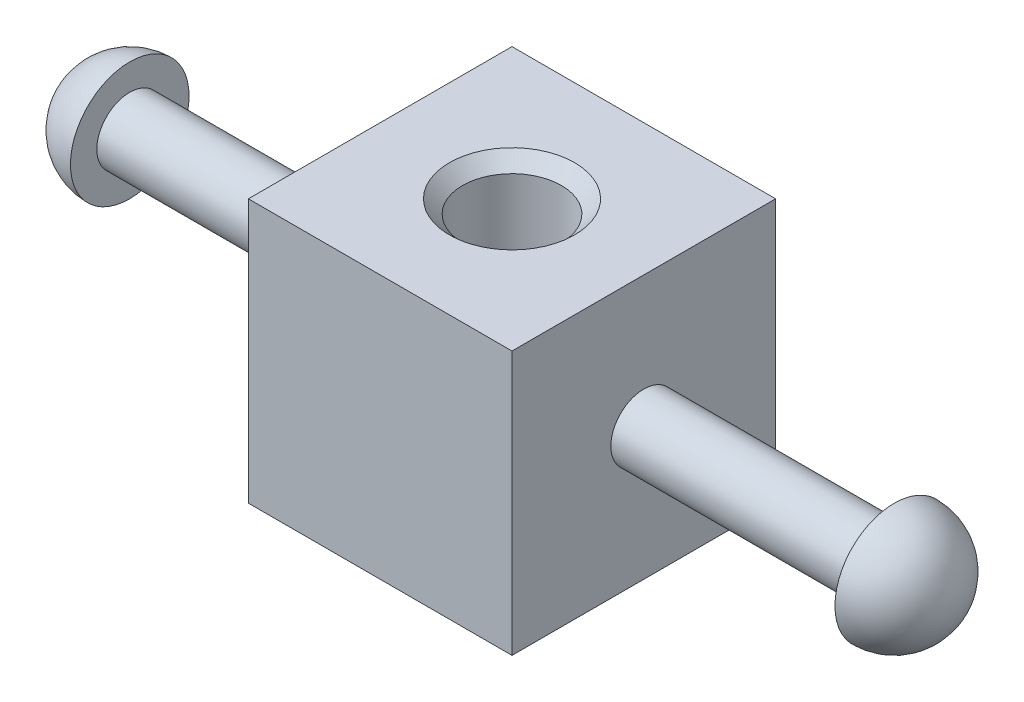
ISO-10303-21;
HEADER;
FILE_DESCRIPTION(('STEP AP214'),'2;1');
FILE_NAME('part.step','',(''),(''),'','','');
FILE_SCHEMA(('AUTOMOTIVE_DESIGN { 1 0 10303 214 1 1 1 1 }'));
ENDSEC;
DATA;
#1=APPLICATION_CONTEXT('core data for automotive mechanical design processes');
#2=APPLICATION_PROTOCOL_DEFINITION('international standard','automotive_design',2000,#1);
#3=PRODUCT_CONTEXT('',#1,'mechanical');
#4=PRODUCT('Part','Part','',(#3));
#5=PRODUCT_RELATED_PRODUCT_CATEGORY('part','',(#4));
#6=PRODUCT_DEFINITION_FORMATION('','',#4);
#7=PRODUCT_DEFINITION_CONTEXT('part definition',#1,'design');
#8=PRODUCT_DEFINITION('design','',#6,#7);
#9=PRODUCT_DEFINITION_SHAPE('','',#8);
#10=(LENGTH_UNIT() NAMED_UNIT(*) SI_UNIT(.MILLI.,.METRE.));
#11=(NAMED_UNIT(*) PLANE_ANGLE_UNIT() SI_UNIT($,.RADIAN.));
#12=(NAMED_UNIT(*) SI_UNIT($,.STERADIAN.) SOLID_ANGLE_UNIT());
#13=UNCERTAINTY_MEASURE_WITH_UNIT(LENGTH_MEASURE(1.E-05),#10,'distance_accuracy_value','');
#14=(GEOMETRIC_REPRESENTATION_CONTEXT(3) GLOBAL_UNCERTAINTY_ASSIGNED_CONTEXT((#13)) GLOBAL_UNIT_ASSIGNED_CONTEXT((#10,
#11,#12)) REPRESENTATION_CONTEXT('',''));
#15=CARTESIAN_POINT('',(0.,0.,0.));
#16=DIRECTION('',(0.,0.,1.));
#17=DIRECTION('',(1.,0.,0.));
#18=AXIS2_PLACEMENT_3D('',#15,#16,#17);
#19=CARTESIAN_POINT('',(0.,25.4,0.));
#20=DIRECTION('',(0.,-1.,0.));
#21=DIRECTION('',(0.,0.,-1.));
#22=AXIS2_PLACEMENT_3D('',#19,#20,#21);
#23=PLANE('',#22);
#24=CARTESIAN_POINT('',(0.,25.4,0.));
#25=DIRECTION('',(0.,-1.,0.));
#26=DIRECTION('',(0.,0.,-1.));
#27=AXIS2_PLACEMENT_3D('',#24,#25,#26);
#28=CIRCLE('',#27,6.03250000000001);
#29=CARTESIAN_POINT('',(0.,25.4,-6.03250000000001));
#30=VERTEX_POINT('',#29);
#31=EDGE_CURVE('E11',#30,#30,#28,.T.);
#32=ORIENTED_EDGE('',*,*,#31,.T.);
#33=EDGE_LOOP('',(#32));
#34=FACE_BOUND('',#33,.T.);
#35=DIRECTION('',(0.,0.,-1.));
#36=VECTOR('',#35,1.);
#37=CARTESIAN_POINT('',(12.7,25.4,12.7));
#38=LINE('',#37,#36);
#39=CARTESIAN_POINT('',(12.7,25.4,12.7));
#40=VERTEX_POINT('',#39);
#41=CARTESIAN_POINT('',(12.7,25.4,-12.7));
#42=VERTEX_POINT('',#41);
#43=EDGE_CURVE('E99',#40,#42,#38,.T.);
#44=ORIENTED_EDGE('',*,*,#43,.T.);
#45=DIRECTION('',(-1.,0.,0.));
#46=VECTOR('',#45,1.);
#47=CARTESIAN_POINT('',(-12.7,25.4,-12.7));
#48=LINE('',#47,#46);
#49=CARTESIAN_POINT('',(-12.7,25.4,-12.7));
#50=VERTEX_POINT('',#49);
#51=EDGE_CURVE('E95',#42,#50,#48,.T.);
#52=ORIENTED_EDGE('',*,*,#51,.T.);
#53=DIRECTION('',(0.,0.,1.));
#54=VECTOR('',#53,1.);
#55=CARTESIAN_POINT('',(-12.7,25.4,12.7));
#56=LINE('',#55,#54);
#57=CARTESIAN_POINT('',(-12.7,25.4,12.7));
#58=VERTEX_POINT('',#57);
#59=EDGE_CURVE('E97',#50,#58,#56,.T.);
#60=ORIENTED_EDGE('',*,*,#59,.T.);
#61=DIRECTION('',(1.,0.,0.));
#62=VECTOR('',#61,1.);
#63=CARTESIAN_POINT('',(-12.7,25.4,12.7));
#64=LINE('',#63,#62);
#65=EDGE_CURVE('E64',#58,#40,#64,.T.);
#66=ORIENTED_EDGE('',*,*,#65,.T.);
#67=EDGE_LOOP('',(#44,#52,#60,#66));
#68=FACE_BOUND('',#67,.T.);
#69=ADVANCED_FACE('F45',(#34,#68),#23,.F.);
#70=CARTESIAN_POINT('',(0.,0.,0.));
#71=DIRECTION('',(0.,-1.,0.));
#72=DIRECTION('',(0.,0.,-1.));
#73=AXIS2_PLACEMENT_3D('',#70,#71,#72);
#74=PLANE('',#73);
#75=CARTESIAN_POINT('',(0.,0.,0.));
#76=DIRECTION('',(0.,-1.,0.));
#77=DIRECTION('',(0.,0.,-1.));
#78=AXIS2_PLACEMENT_3D('',#75,#76,#77);
#79=CIRCLE('',#78,6.0325);
#80=CARTESIAN_POINT('',(0.,0.,-6.0325));
#81=VERTEX_POINT('',#80);
#82=EDGE_CURVE('E135',#81,#81,#79,.F.);
#83=ORIENTED_EDGE('',*,*,#82,.T.);
#84=EDGE_LOOP('',(#83));
#85=FACE_BOUND('',#84,.T.);
#86=DIRECTION('',(0.,0.,-1.));
#87=VECTOR('',#86,1.);
#88=CARTESIAN_POINT('',(12.7,0.,12.7));
#89=LINE('',#88,#87);
#90=CARTESIAN_POINT('',(12.7,0.,12.7));
#91=VERTEX_POINT('',#90);
#92=CARTESIAN_POINT('',(12.7,0.,-12.7));
#93=VERTEX_POINT('',#92);
#94=EDGE_CURVE('E118',#91,#93,#89,.T.);
#95=ORIENTED_EDGE('',*,*,#94,.F.);
#96=DIRECTION('',(1.,0.,0.));
#97=VECTOR('',#96,1.);
#98=CARTESIAN_POINT('',(-12.7,0.,12.7));
#99=LINE('',#98,#97);
#100=CARTESIAN_POINT('',(-12.7,0.,12.7));
#101=VERTEX_POINT('',#100);
#102=EDGE_CURVE('E87',#101,#91,#99,.T.);
#103=ORIENTED_EDGE('',*,*,#102,.F.);
#104=DIRECTION('',(0.,0.,1.));
#105=VECTOR('',#104,1.);
#106=CARTESIAN_POINT('',(-12.7,0.,12.7));
#107=LINE('',#106,#105);
#108=CARTESIAN_POINT('',(-12.7,0.,-12.7));
#109=VERTEX_POINT('',#108);
#110=EDGE_CURVE('E81',#109,#101,#107,.T.);
#111=ORIENTED_EDGE('',*,*,#110,.F.);
#112=DIRECTION('',(-1.,0.,0.));
#113=VECTOR('',#112,1.);
#114=CARTESIAN_POINT('',(-12.7,0.,-12.7));
#115=LINE('',#114,#113);
#116=EDGE_CURVE('E105',#93,#109,#115,.T.);
#117=ORIENTED_EDGE('',*,*,#116,.F.);
#118=EDGE_LOOP('',(#95,#103,#111,#117));
#119=FACE_BOUND('',#118,.T.);
#120=ADVANCED_FACE('F154',(#85,#119),#74,.T.);
#121=CARTESIAN_POINT('',(12.7,25.4,12.7));
#122=DIRECTION('',(-1.,0.,0.));
#123=DIRECTION('',(0.,0.,1.));
#124=AXIS2_PLACEMENT_3D('',#121,#122,#123);
#125=PLANE('',#124);
#126=CARTESIAN_POINT('',(12.7,12.7,0.));
#127=DIRECTION('',(-1.,0.,0.));
#128=DIRECTION('',(0.,0.,1.));
#129=AXIS2_PLACEMENT_3D('',#126,#127,#128);
#130=CIRCLE('',#129,3.175);
#131=CARTESIAN_POINT('',(12.7,12.7,3.175));
#132=VERTEX_POINT('',#131);
#133=EDGE_CURVE('E122',#132,#132,#130,.T.);
#134=ORIENTED_EDGE('',*,*,#133,.T.);
#135=EDGE_LOOP('',(#134));
#136=FACE_BOUND('',#135,.T.);
#137=ORIENTED_EDGE('',*,*,#94,.T.);
#138=DIRECTION('',(0.,-1.,0.));
#139=VECTOR('',#138,1.);
#140=CARTESIAN_POINT('',(12.7,25.4,-12.7));
#141=LINE('',#140,#139);
#142=EDGE_CURVE('E107',#42,#93,#141,.T.);
#143=ORIENTED_EDGE('',*,*,#142,.F.);
#144=ORIENTED_EDGE('',*,*,#43,.F.);
#145=DIRECTION('',(0.,-1.,0.));
#146=VECTOR('',#145,1.);
#147=CARTESIAN_POINT('',(12.7,25.4,12.7));
#148=LINE('',#147,#146);
#149=EDGE_CURVE('E114',#40,#91,#148,.T.);
#150=ORIENTED_EDGE('',*,*,#149,.T.);
#151=EDGE_LOOP('',(#137,#143,#144,#150));
#152=FACE_BOUND('',#151,.T.);
#153=ADVANCED_FACE('F157',(#136,#152),#125,.F.);
#154=CARTESIAN_POINT('',(-12.7,25.4,-12.7));
#155=DIRECTION('',(0.,0.,1.));
#156=DIRECTION('',(1.,0.,0.));
#157=AXIS2_PLACEMENT_3D('',#154,#155,#156);
#158=PLANE('',#157);
#159=ORIENTED_EDGE('',*,*,#116,.T.);
#160=DIRECTION('',(0.,-1.,0.));
#161=VECTOR('',#160,1.);
#162=CARTESIAN_POINT('',(-12.7,25.4,-12.7));
#163=LINE('',#162,#161);
#164=EDGE_CURVE('E103',#50,#109,#163,.T.);
#165=ORIENTED_EDGE('',*,*,#164,.F.);
#166=ORIENTED_EDGE('',*,*,#51,.F.);
#167=ORIENTED_EDGE('',*,*,#142,.T.);
#168=EDGE_LOOP('',(#159,#165,#166,#167));
#169=FACE_BOUND('',#168,.T.);
#170=ADVANCED_FACE('F104',(#169),#158,.F.);
#171=CARTESIAN_POINT('',(-12.7,25.4,12.7));
#172=DIRECTION('',(1.,0.,0.));
#173=DIRECTION('',(0.,0.,-1.));
#174=AXIS2_PLACEMENT_3D('',#171,#172,#173);
#175=PLANE('',#174);
#176=CARTESIAN_POINT('',(-12.7,12.7,0.));
#177=DIRECTION('',(1.,0.,0.));
#178=DIRECTION('',(0.,0.,-1.));
#179=AXIS2_PLACEMENT_3D('',#176,#177,#178);
#180=CIRCLE('',#179,3.175);
#181=CARTESIAN_POINT('',(-12.7,12.7,-3.175));
#182=VERTEX_POINT('',#181);
#183=EDGE_CURVE('E220',#182,#182,#180,.T.);
#184=ORIENTED_EDGE('',*,*,#183,.T.);
#185=EDGE_LOOP('',(#184));
#186=FACE_BOUND('',#185,.T.);
#187=ORIENTED_EDGE('',*,*,#110,.T.);
#188=DIRECTION('',(0.,-1.,0.));
#189=VECTOR('',#188,1.);
#190=CARTESIAN_POINT('',(-12.7,25.4,12.7));
#191=LINE('',#190,#189);
#192=EDGE_CURVE('E108',#58,#101,#191,.T.);
#193=ORIENTED_EDGE('',*,*,#192,.F.);
#194=ORIENTED_EDGE('',*,*,#59,.F.);
#195=ORIENTED_EDGE('',*,*,#164,.T.);
#196=EDGE_LOOP('',(#187,#193,#194,#195));
#197=FACE_BOUND('',#196,.T.);
#198=ADVANCED_FACE('F110',(#186,#197),#175,.F.);
#199=CARTESIAN_POINT('',(-12.7,25.4,12.7));
#200=DIRECTION('',(0.,0.,-1.));
#201=DIRECTION('',(-1.,0.,0.));
#202=AXIS2_PLACEMENT_3D('',#199,#200,#201);
#203=PLANE('',#202);
#204=ORIENTED_EDGE('',*,*,#102,.T.);
#205=ORIENTED_EDGE('',*,*,#149,.F.);
#206=ORIENTED_EDGE('',*,*,#65,.F.);
#207=ORIENTED_EDGE('',*,*,#192,.T.);
#208=EDGE_LOOP('',(#204,#205,#206,#207));
#209=FACE_BOUND('',#208,.T.);
#210=ADVANCED_FACE('F161',(#209),#203,.F.);
#211=CARTESIAN_POINT('',(0.,25.4,0.));
#212=DIRECTION('',(0.,-1.,0.));
#213=DIRECTION('',(0.,0.,-1.));
#214=AXIS2_PLACEMENT_3D('',#211,#212,#213);
#215=CYLINDRICAL_SURFACE('',#214,4.7625);
#216=CARTESIAN_POINT('',(0.,1.27,0.));
#217=DIRECTION('',(0.,-1.,0.));
#218=DIRECTION('',(0.,0.,-1.));
#219=AXIS2_PLACEMENT_3D('',#216,#217,#218);
#220=CIRCLE('',#219,4.7625);
#221=CARTESIAN_POINT('',(0.,1.27,-4.7625));
#222=VERTEX_POINT('',#221);
#223=EDGE_CURVE('E56',#222,#222,#220,.T.);
#224=ORIENTED_EDGE('',*,*,#223,.T.);
#225=EDGE_LOOP('',(#224));
#226=FACE_BOUND('',#225,.T.);
#227=CARTESIAN_POINT('',(0.,24.13,0.));
#228=DIRECTION('',(0.,-1.,0.));
#229=DIRECTION('',(0.,0.,-1.));
#230=AXIS2_PLACEMENT_3D('',#227,#228,#229);
#231=CIRCLE('',#230,4.7625);
#232=CARTESIAN_POINT('',(0.,24.13,-4.7625));
#233=VERTEX_POINT('',#232);
#234=EDGE_CURVE('E139',#233,#233,#231,.F.);
#235=ORIENTED_EDGE('',*,*,#234,.T.);
#236=EDGE_LOOP('',(#235));
#237=FACE_BOUND('',#236,.T.);
#238=ADVANCED_FACE('F146',(#226,#237),#215,.F.);
#239=CARTESIAN_POINT('',(0.,0.,0.));
#240=DIRECTION('',(0.,-1.,0.));
#241=DIRECTION('',(0.,0.,-1.));
#242=AXIS2_PLACEMENT_3D('',#239,#240,#241);
#243=CONICAL_SURFACE('',#242,6.0325,0.785398163397447);
#244=ORIENTED_EDGE('',*,*,#223,.F.);
#245=EDGE_LOOP('',(#244));
#246=FACE_BOUND('',#245,.T.);
#247=ORIENTED_EDGE('',*,*,#82,.F.);
#248=EDGE_LOOP('',(#247));
#249=FACE_BOUND('',#248,.T.);
#250=ADVANCED_FACE('F149',(#246,#249),#243,.F.);
#251=CARTESIAN_POINT('',(0.,24.13,0.));
#252=DIRECTION('',(0.,1.,0.));
#253=DIRECTION('',(0.,0.,1.));
#254=AXIS2_PLACEMENT_3D('',#251,#252,#253);
#255=CONICAL_SURFACE('',#254,4.7625,0.785398163397449);
#256=ORIENTED_EDGE('',*,*,#31,.F.);
#257=EDGE_LOOP('',(#256));
#258=FACE_BOUND('',#257,.T.);
#259=ORIENTED_EDGE('',*,*,#234,.F.);
#260=EDGE_LOOP('',(#259));
#261=FACE_BOUND('',#260,.T.);
#262=ADVANCED_FACE('F48',(#258,#261),#255,.F.);
#263=CARTESIAN_POINT('',(-36.83,12.7,0.));
#264=DIRECTION('',(-1.,0.,0.));
#265=DIRECTION('',(0.,0.,-1.));
#266=AXIS2_PLACEMENT_3D('',#263,#264,#265);
#267=SPHERICAL_SURFACE('',#266,5.715);
#268=CARTESIAN_POINT('',(-36.83,12.7,0.));
#269=DIRECTION('',(-1.,0.,0.));
#270=DIRECTION('',(0.,0.,1.));
#271=AXIS2_PLACEMENT_3D('',#268,#269,#270);
#272=CIRCLE('',#271,5.715);
#273=CARTESIAN_POINT('',(-36.83,12.7,5.715));
#274=VERTEX_POINT('',#273);
#275=EDGE_CURVE('E203',#274,#274,#272,.T.);
#276=ORIENTED_EDGE('',*,*,#275,.T.);
#277=EDGE_LOOP('',(#276));
#278=FACE_BOUND('',#277,.T.);
#279=ADVANCED_FACE('F181',(#278),#267,.T.);
#280=CARTESIAN_POINT('',(-36.83,12.7,3.175));
#281=DIRECTION('',(1.,0.,0.));
#282=DIRECTION('',(0.,0.,-1.));
#283=AXIS2_PLACEMENT_3D('',#280,#281,#282);
#284=PLANE('',#283);
#285=CARTESIAN_POINT('',(-36.83,12.7,0.));
#286=DIRECTION('',(-1.,0.,0.));
#287=DIRECTION('',(0.,0.,1.));
#288=AXIS2_PLACEMENT_3D('',#285,#286,#287);
#289=CIRCLE('',#288,3.175);
#290=CARTESIAN_POINT('',(-36.83,12.7,3.175));
#291=VERTEX_POINT('',#290);
#292=EDGE_CURVE('E216',#291,#291,#289,.T.);
#293=ORIENTED_EDGE('',*,*,#292,.T.);
#294=EDGE_LOOP('',(#293));
#295=FACE_BOUND('',#294,.T.);
#296=ORIENTED_EDGE('',*,*,#275,.F.);
#297=EDGE_LOOP('',(#296));
#298=FACE_BOUND('',#297,.T.);
#299=ADVANCED_FACE('F177',(#295,#298),#284,.T.);
#300=CARTESIAN_POINT('',(-42.545,12.7,0.));
#301=DIRECTION('',(-1.,0.,0.));
#302=DIRECTION('',(0.,0.,1.));
#303=AXIS2_PLACEMENT_3D('',#300,#301,#302);
#304=CYLINDRICAL_SURFACE('',#303,3.175);
#305=ORIENTED_EDGE('',*,*,#292,.F.);
#306=EDGE_LOOP('',(#305));
#307=FACE_BOUND('',#306,.T.);
#308=ORIENTED_EDGE('',*,*,#183,.F.);
#309=EDGE_LOOP('',(#308));
#310=FACE_BOUND('',#309,.T.);
#311=ADVANCED_FACE('F180',(#307,#310),#304,.T.);
#312=CARTESIAN_POINT('',(36.83,12.7,0.));
#313=DIRECTION('',(-1.,0.,0.));
#314=DIRECTION('',(0.,0.,1.));
#315=AXIS2_PLACEMENT_3D('',#312,#313,#314);
#316=CIRCLE('',#315,3.175);
#317=CARTESIAN_POINT('',(36.83,12.7,3.175));
#318=VERTEX_POINT('',#317);
#319=EDGE_CURVE('E210',#318,#318,#316,.T.);
#320=ORIENTED_EDGE('',*,*,#319,.T.);
#321=EDGE_LOOP('',(#320));
#322=FACE_BOUND('',#321,.T.);
#323=ORIENTED_EDGE('',*,*,#133,.F.);
#324=EDGE_LOOP('',(#323));
#325=FACE_BOUND('',#324,.T.);
#326=ADVANCED_FACE('F183',(#322,#325),#304,.T.);
#327=CARTESIAN_POINT('',(36.83,12.7,3.175));
#328=DIRECTION('',(-1.,0.,0.));
#329=DIRECTION('',(0.,0.,1.));
#330=AXIS2_PLACEMENT_3D('',#327,#328,#329);
#331=PLANE('',#330);
#332=CARTESIAN_POINT('',(36.83,12.7,0.));
#333=DIRECTION('',(-1.,0.,0.));
#334=DIRECTION('',(0.,0.,1.));
#335=AXIS2_PLACEMENT_3D('',#332,#333,#334);
#336=CIRCLE('',#335,5.715);
#337=CARTESIAN_POINT('',(36.83,12.7,5.715));
#338=VERTEX_POINT('',#337);
#339=EDGE_CURVE('E206',#338,#338,#336,.T.);
#340=ORIENTED_EDGE('',*,*,#339,.T.);
#341=EDGE_LOOP('',(#340));
#342=FACE_BOUND('',#341,.T.);
#343=ORIENTED_EDGE('',*,*,#319,.F.);
#344=EDGE_LOOP('',(#343));
#345=FACE_BOUND('',#344,.T.);
#346=ADVANCED_FACE('F186',(#342,#345),#331,.T.);
#347=CARTESIAN_POINT('',(36.83,12.7,0.));
#348=DIRECTION('',(-1.,0.,0.));
#349=DIRECTION('',(0.,0.,1.));
#350=AXIS2_PLACEMENT_3D('',#347,#348,#349);
#351=SPHERICAL_SURFACE('',#350,5.715);
#352=ORIENTED_EDGE('',*,*,#339,.F.);
#353=EDGE_LOOP('',(#352));
#354=FACE_BOUND('',#353,.T.);
#355=ADVANCED_FACE('F190',(#354),#351,.T.);
#356=CLOSED_SHELL('',(#69,#120,#153,#170,#198,#210,#238,#250,#262,#279,#299,#311,#326,#346,#355));
#357=MANIFOLD_SOLID_BREP('B2',#356);
#358=ADVANCED_BREP_SHAPE_REPRESENTATION('',(#18,#357),#14);
#359=SHAPE_DEFINITION_REPRESENTATION(#9,#358);
ENDSEC;
END-ISO-10303-21;
